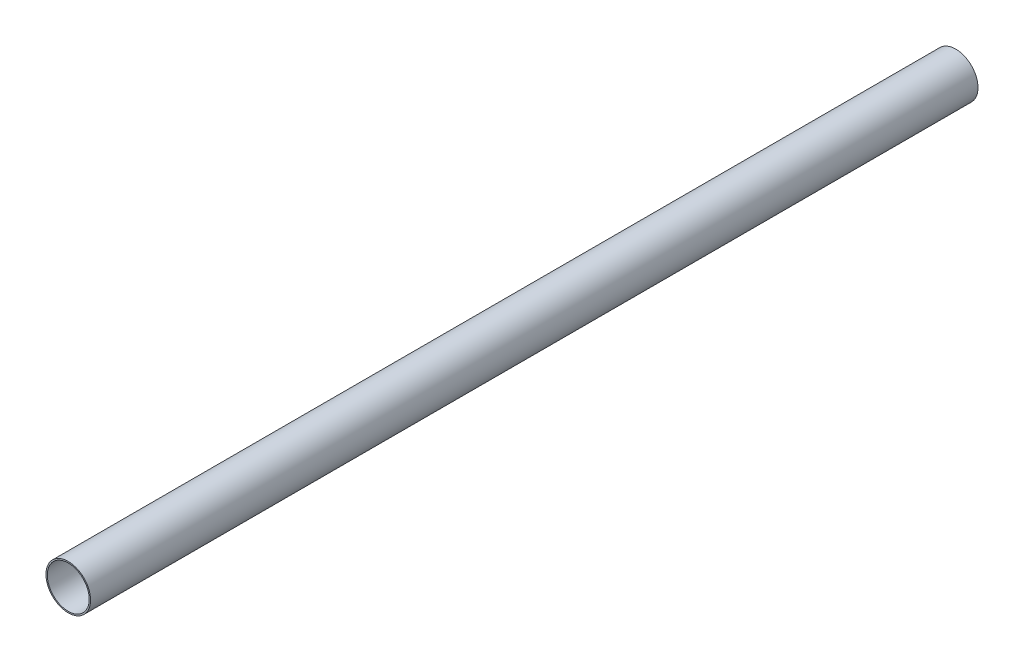
ISO-10303-21;
HEADER;
FILE_DESCRIPTION(('STEP AP214'),'2;1');
FILE_NAME('part.step','',(''),(''),'','','');
FILE_SCHEMA(('AUTOMOTIVE_DESIGN { 1 0 10303 214 1 1 1 1 }'));
ENDSEC;
DATA;
#1=APPLICATION_CONTEXT('core data for automotive mechanical design processes');
#2=APPLICATION_PROTOCOL_DEFINITION('international standard','automotive_design',2000,#1);
#3=PRODUCT_CONTEXT('',#1,'mechanical');
#4=PRODUCT('Part','Part','',(#3));
#5=PRODUCT_RELATED_PRODUCT_CATEGORY('part','',(#4));
#6=PRODUCT_DEFINITION_FORMATION('','',#4);
#7=PRODUCT_DEFINITION_CONTEXT('part definition',#1,'design');
#8=PRODUCT_DEFINITION('design','',#6,#7);
#9=PRODUCT_DEFINITION_SHAPE('','',#8);
#10=(LENGTH_UNIT() NAMED_UNIT(*) SI_UNIT(.MILLI.,.METRE.));
#11=(NAMED_UNIT(*) PLANE_ANGLE_UNIT() SI_UNIT($,.RADIAN.));
#12=(NAMED_UNIT(*) SI_UNIT($,.STERADIAN.) SOLID_ANGLE_UNIT());
#13=UNCERTAINTY_MEASURE_WITH_UNIT(LENGTH_MEASURE(1.E-05),#10,'distance_accuracy_value','');
#14=(GEOMETRIC_REPRESENTATION_CONTEXT(3) GLOBAL_UNCERTAINTY_ASSIGNED_CONTEXT((#13)) GLOBAL_UNIT_ASSIGNED_CONTEXT((#10,
#11,#12)) REPRESENTATION_CONTEXT('',''));
#15=CARTESIAN_POINT('',(0.,0.,0.));
#16=DIRECTION('',(0.,0.,1.));
#17=DIRECTION('',(1.,0.,0.));
#18=AXIS2_PLACEMENT_3D('',#15,#16,#17);
#19=CARTESIAN_POINT('',(0.,0.,995.));
#20=DIRECTION('',(0.,0.,1.));
#21=DIRECTION('',(1.,0.,0.));
#22=AXIS2_PLACEMENT_3D('',#19,#20,#21);
#23=PLANE('',#22);
#24=CARTESIAN_POINT('',(0.,0.,995.));
#25=DIRECTION('',(0.,0.,1.));
#26=DIRECTION('',(1.,0.,0.));
#27=AXIS2_PLACEMENT_3D('',#24,#25,#26);
#28=CIRCLE('',#27,25.);
#29=CARTESIAN_POINT('',(25.,0.,995.));
#30=VERTEX_POINT('',#29);
#31=EDGE_CURVE('E10',#30,#30,#28,.T.);
#32=ORIENTED_EDGE('',*,*,#31,.T.);
#33=EDGE_LOOP('',(#32));
#34=FACE_BOUND('',#33,.T.);
#35=CARTESIAN_POINT('',(0.,0.,995.));
#36=DIRECTION('',(0.,0.,1.));
#37=DIRECTION('',(1.,0.,0.));
#38=AXIS2_PLACEMENT_3D('',#35,#36,#37);
#39=CIRCLE('',#38,23.5);
#40=CARTESIAN_POINT('',(23.5,0.,995.));
#41=VERTEX_POINT('',#40);
#42=EDGE_CURVE('E47',#41,#41,#39,.T.);
#43=ORIENTED_EDGE('',*,*,#42,.F.);
#44=EDGE_LOOP('',(#43));
#45=FACE_BOUND('',#44,.T.);
#46=ADVANCED_FACE('F36',(#34,#45),#23,.T.);
#47=CARTESIAN_POINT('',(0.,0.,0.));
#48=DIRECTION('',(0.,0.,1.));
#49=DIRECTION('',(1.,0.,0.));
#50=AXIS2_PLACEMENT_3D('',#47,#48,#49);
#51=PLANE('',#50);
#52=CARTESIAN_POINT('',(0.,0.,0.));
#53=DIRECTION('',(0.,0.,1.));
#54=DIRECTION('',(1.,0.,0.));
#55=AXIS2_PLACEMENT_3D('',#52,#53,#54);
#56=CIRCLE('',#55,25.);
#57=CARTESIAN_POINT('',(25.,0.,0.));
#58=VERTEX_POINT('',#57);
#59=EDGE_CURVE('E40',#58,#58,#56,.T.);
#60=ORIENTED_EDGE('',*,*,#59,.F.);
#61=EDGE_LOOP('',(#60));
#62=FACE_BOUND('',#61,.T.);
#63=CARTESIAN_POINT('',(0.,0.,0.));
#64=DIRECTION('',(0.,0.,1.));
#65=DIRECTION('',(1.,0.,0.));
#66=AXIS2_PLACEMENT_3D('',#63,#64,#65);
#67=CIRCLE('',#66,23.5);
#68=CARTESIAN_POINT('',(23.5,0.,0.));
#69=VERTEX_POINT('',#68);
#70=EDGE_CURVE('E49',#69,#69,#67,.T.);
#71=ORIENTED_EDGE('',*,*,#70,.T.);
#72=EDGE_LOOP('',(#71));
#73=FACE_BOUND('',#72,.T.);
#74=ADVANCED_FACE('F59',(#62,#73),#51,.F.);
#75=CARTESIAN_POINT('',(0.,0.,995.));
#76=DIRECTION('',(0.,0.,-1.));
#77=DIRECTION('',(-1.,0.,0.));
#78=AXIS2_PLACEMENT_3D('',#75,#76,#77);
#79=CYLINDRICAL_SURFACE('',#78,25.);
#80=ORIENTED_EDGE('',*,*,#31,.F.);
#81=EDGE_LOOP('',(#80));
#82=FACE_BOUND('',#81,.T.);
#83=ORIENTED_EDGE('',*,*,#59,.T.);
#84=EDGE_LOOP('',(#83));
#85=FACE_BOUND('',#84,.T.);
#86=ADVANCED_FACE('F38',(#82,#85),#79,.T.);
#87=CARTESIAN_POINT('',(0.,0.,995.));
#88=DIRECTION('',(0.,0.,-1.));
#89=DIRECTION('',(-1.,0.,0.));
#90=AXIS2_PLACEMENT_3D('',#87,#88,#89);
#91=CYLINDRICAL_SURFACE('',#90,23.5);
#92=ORIENTED_EDGE('',*,*,#42,.T.);
#93=EDGE_LOOP('',(#92));
#94=FACE_BOUND('',#93,.T.);
#95=ORIENTED_EDGE('',*,*,#70,.F.);
#96=EDGE_LOOP('',(#95));
#97=FACE_BOUND('',#96,.T.);
#98=ADVANCED_FACE('F55',(#94,#97),#91,.F.);
#99=CLOSED_SHELL('',(#46,#74,#86,#98));
#100=MANIFOLD_SOLID_BREP('B2',#99);
#101=ADVANCED_BREP_SHAPE_REPRESENTATION('',(#18,#100),#14);
#102=SHAPE_DEFINITION_REPRESENTATION(#9,#101);
ENDSEC;
END-ISO-10303-21;
